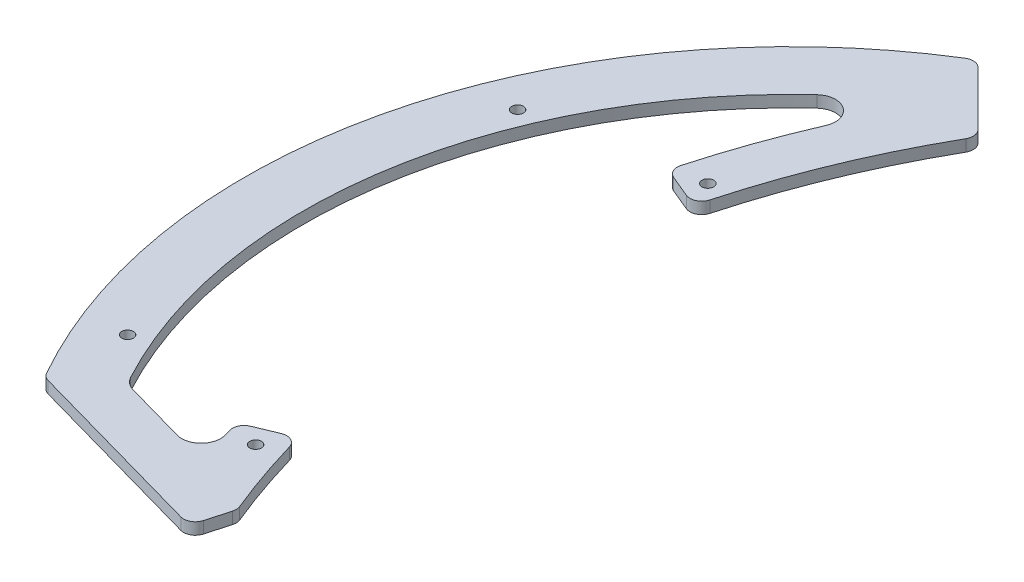
ISO-10303-21;
HEADER;
FILE_DESCRIPTION(('STEP AP214'),'2;1');
FILE_NAME('part.step','',(''),(''),'','','');
FILE_SCHEMA(('AUTOMOTIVE_DESIGN { 1 0 10303 214 1 1 1 1 }'));
ENDSEC;
DATA;
#1=APPLICATION_CONTEXT('core data for automotive mechanical design processes');
#2=APPLICATION_PROTOCOL_DEFINITION('international standard','automotive_design',2000,#1);
#3=PRODUCT_CONTEXT('',#1,'mechanical');
#4=PRODUCT('Part','Part','',(#3));
#5=PRODUCT_RELATED_PRODUCT_CATEGORY('part','',(#4));
#6=PRODUCT_DEFINITION_FORMATION('','',#4);
#7=PRODUCT_DEFINITION_CONTEXT('part definition',#1,'design');
#8=PRODUCT_DEFINITION('design','',#6,#7);
#9=PRODUCT_DEFINITION_SHAPE('','',#8);
#10=(LENGTH_UNIT() NAMED_UNIT(*) SI_UNIT(.MILLI.,.METRE.));
#11=(NAMED_UNIT(*) PLANE_ANGLE_UNIT() SI_UNIT($,.RADIAN.));
#12=(NAMED_UNIT(*) SI_UNIT($,.STERADIAN.) SOLID_ANGLE_UNIT());
#13=UNCERTAINTY_MEASURE_WITH_UNIT(LENGTH_MEASURE(1.E-05),#10,'distance_accuracy_value','');
#14=(GEOMETRIC_REPRESENTATION_CONTEXT(3) GLOBAL_UNCERTAINTY_ASSIGNED_CONTEXT((#13)) GLOBAL_UNIT_ASSIGNED_CONTEXT((#10,
#11,#12)) REPRESENTATION_CONTEXT('',''));
#15=CARTESIAN_POINT('',(0.,0.,0.));
#16=DIRECTION('',(0.,0.,1.));
#17=DIRECTION('',(1.,0.,0.));
#18=AXIS2_PLACEMENT_3D('',#15,#16,#17);
#19=CARTESIAN_POINT('',(117.63315270432,440.56606049208,-1.90202025355329));
#20=DIRECTION('',(0.,-1.,0.));
#21=DIRECTION('',(0.,0.,-1.));
#22=AXIS2_PLACEMENT_3D('',#19,#20,#21);
#23=CYLINDRICAL_SURFACE('',#22,200.);
#24=CARTESIAN_POINT('',(117.63315270432,3.,-1.90202025355329));
#25=DIRECTION('',(0.,1.,0.));
#26=DIRECTION('',(0.,0.,1.));
#27=AXIS2_PLACEMENT_3D('',#24,#25,#26);
#28=CIRCLE('',#27,200.);
#29=CARTESIAN_POINT('',(-75.2973863266759,3.,-54.6069261846831));
#30=VERTEX_POINT('',#29);
#31=CARTESIAN_POINT('',(-56.0777887900128,3.,-101.020680480336));
#32=VERTEX_POINT('',#31);
#33=EDGE_CURVE('E434',#30,#32,#28,.F.);
#34=ORIENTED_EDGE('',*,*,#33,.F.);
#35=DIRECTION('',(0.,-1.,0.));
#36=VECTOR('',#35,1.);
#37=CARTESIAN_POINT('',(-75.297386326676,440.56606049208,-54.6069261846831));
#38=LINE('',#37,#36);
#39=CARTESIAN_POINT('',(-75.2973863266759,0.,-54.6069261846831));
#40=VERTEX_POINT('',#39);
#41=EDGE_CURVE('E306',#30,#40,#38,.T.);
#42=ORIENTED_EDGE('',*,*,#41,.T.);
#43=CARTESIAN_POINT('',(117.63315270432,0.,-1.90202025355329));
#44=DIRECTION('',(0.,1.,0.));
#45=DIRECTION('',(0.,0.,1.));
#46=AXIS2_PLACEMENT_3D('',#43,#44,#45);
#47=CIRCLE('',#46,200.);
#48=CARTESIAN_POINT('',(-56.0777887900128,0.,-101.020680480336));
#49=VERTEX_POINT('',#48);
#50=EDGE_CURVE('E435',#40,#49,#47,.F.);
#51=ORIENTED_EDGE('',*,*,#50,.T.);
#52=DIRECTION('',(0.,-1.,0.));
#53=VECTOR('',#52,1.);
#54=CARTESIAN_POINT('',(-56.0777887900128,440.56606049208,-101.020680480336));
#55=LINE('',#54,#53);
#56=EDGE_CURVE('E304',#49,#32,#55,.F.);
#57=ORIENTED_EDGE('',*,*,#56,.T.);
#58=EDGE_LOOP('',(#34,#42,#51,#57));
#59=FACE_BOUND('',#58,.T.);
#60=ADVANCED_FACE('F37',(#59),#23,.F.);
#61=CARTESIAN_POINT('',(0.,3.,0.));
#62=DIRECTION('',(0.,1.,0.));
#63=DIRECTION('',(0.,0.,1.));
#64=AXIS2_PLACEMENT_3D('',#61,#62,#63);
#65=PLANE('',#64);
#66=DIRECTION('',(0.923076923076923,0.,-0.384615384615384));
#67=VECTOR('',#66,1.);
#68=CARTESIAN_POINT('',(-86.4256486374716,3.,55.5784598675379));
#69=LINE('',#68,#67);
#70=CARTESIAN_POINT('',(-83.9551064148083,3.,54.5490672747615));
#71=VERTEX_POINT('',#70);
#72=CARTESIAN_POINT('',(-78.3835260871652,3.,52.2275754715769));
#73=VERTEX_POINT('',#72);
#74=EDGE_CURVE('E442',#71,#73,#69,.T.);
#75=ORIENTED_EDGE('',*,*,#74,.F.);
#76=CARTESIAN_POINT('',(-82.8012602609622,3.,57.3182980439923));
#77=DIRECTION('',(0.,1.,0.));
#78=DIRECTION('',(0.,0.,1.));
#79=AXIS2_PLACEMENT_3D('',#76,#77,#78);
#80=CIRCLE('',#79,3.);
#81=CARTESIAN_POINT('',(-85.6783092508945,3.,58.1683504597466));
#82=VERTEX_POINT('',#81);
#83=EDGE_CURVE('E272',#71,#82,#80,.T.);
#84=ORIENTED_EDGE('',*,*,#83,.T.);
#85=CARTESIAN_POINT('',(117.63315270432,3.,-1.90202025355329));
#86=DIRECTION('',(0.,-1.,0.));
#87=DIRECTION('',(0.,0.,-1.));
#88=AXIS2_PLACEMENT_3D('',#85,#86,#87);
#89=CIRCLE('',#88,212.);
#90=CARTESIAN_POINT('',(-85.2325066824361,3.,59.6570915137276));
#91=VERTEX_POINT('',#90);
#92=EDGE_CURVE('E450',#91,#82,#89,.T.);
#93=ORIENTED_EDGE('',*,*,#92,.F.);
#94=CARTESIAN_POINT('',(-90.0170741208029,3.,61.1089573572956));
#95=DIRECTION('',(0.,1.,0.));
#96=DIRECTION('',(0.,0.,1.));
#97=AXIS2_PLACEMENT_3D('',#94,#95,#96);
#98=CIRCLE('',#97,5.);
#99=CARTESIAN_POINT('',(-91.3684693577962,3.,65.9228675053386));
#100=VERTEX_POINT('',#99);
#101=EDGE_CURVE('E221',#91,#100,#98,.F.);
#102=ORIENTED_EDGE('',*,*,#101,.T.);
#103=DIRECTION('',(0.962782029608611,0.,0.270279047398652));
#104=VECTOR('',#103,1.);
#105=CARTESIAN_POINT('',(-109.142815318778,3.,60.9331261654206));
#106=LINE('',#105,#104);
#107=CARTESIAN_POINT('',(-107.117650370331,3.,61.5016449331774));
#108=VERTEX_POINT('',#107);
#109=EDGE_CURVE('E455',#108,#100,#106,.T.);
#110=ORIENTED_EDGE('',*,*,#109,.F.);
#111=CARTESIAN_POINT('',(-105.766255133338,3.,56.6877347851343));
#112=DIRECTION('',(0.,1.,0.));
#113=DIRECTION('',(0.,0.,1.));
#114=AXIS2_PLACEMENT_3D('',#111,#112,#113);
#115=CIRCLE('',#114,5.);
#116=CARTESIAN_POINT('',(-110.17318243056,3.,59.0497237345149));
#117=VERTEX_POINT('',#116);
#118=EDGE_CURVE('E220',#108,#117,#115,.F.);
#119=ORIENTED_EDGE('',*,*,#118,.T.);
#120=CARTESIAN_POINT('',(0.,3.,0.));
#121=DIRECTION('',(0.,1.,0.));
#122=DIRECTION('',(0.,0.,1.));
#123=AXIS2_PLACEMENT_3D('',#120,#121,#122);
#124=CIRCLE('',#123,125.);
#125=CARTESIAN_POINT('',(-84.9336652152009,3.,-91.712989882089));
#126=VERTEX_POINT('',#125);
#127=EDGE_CURVE('E725',#126,#117,#124,.T.);
#128=ORIENTED_EDGE('',*,*,#127,.F.);
#129=CARTESIAN_POINT('',(-81.5363186065929,3.,-88.0444702868055));
#130=DIRECTION('',(0.,1.,0.));
#131=DIRECTION('',(0.,0.,1.));
#132=AXIS2_PLACEMENT_3D('',#129,#130,#131);
#133=CIRCLE('',#132,5.);
#134=CARTESIAN_POINT('',(-76.9471602814566,3.,-86.0596212076983));
#135=VERTEX_POINT('',#134);
#136=EDGE_CURVE('E246',#126,#135,#133,.F.);
#137=ORIENTED_EDGE('',*,*,#136,.T.);
#138=CARTESIAN_POINT('',(117.63315270432,3.,-1.90202025355329));
#139=DIRECTION('',(0.,-1.,0.));
#140=DIRECTION('',(0.,0.,-1.));
#141=AXIS2_PLACEMENT_3D('',#138,#139,#140);
#142=CIRCLE('',#141,212.);
#143=CARTESIAN_POINT('',(-86.665258670334,3.,-58.5249759322579));
#144=VERTEX_POINT('',#143);
#145=EDGE_CURVE('E453',#144,#135,#142,.T.);
#146=ORIENTED_EDGE('',*,*,#145,.F.);
#147=CARTESIAN_POINT('',(-83.7742434150322,3.,-57.7237076915215));
#148=DIRECTION('',(0.,1.,0.));
#149=DIRECTION('',(0.,0.,1.));
#150=AXIS2_PLACEMENT_3D('',#147,#148,#149);
#151=CIRCLE('',#150,3.);
#152=CARTESIAN_POINT('',(-84.9280895688784,3.,-54.9544769222907));
#153=VERTEX_POINT('',#152);
#154=EDGE_CURVE('E268',#144,#153,#151,.T.);
#155=ORIENTED_EDGE('',*,*,#154,.T.);
#156=DIRECTION('',(-0.923076923076923,0.,-0.384615384615384));
#157=VECTOR('',#156,1.);
#158=CARTESIAN_POINT('',(-87.3571468989254,3.,-55.9665841431436));
#159=LINE('',#158,#157);
#160=CARTESIAN_POINT('',(-79.345190565987,3.,-52.6282690044193));
#161=VERTEX_POINT('',#160);
#162=EDGE_CURVE('E449',#161,#153,#159,.T.);
#163=ORIENTED_EDGE('',*,*,#162,.F.);
#164=CARTESIAN_POINT('',(-78.1913444121409,3.,-55.3974997736501));
#165=DIRECTION('',(0.,1.,0.));
#166=DIRECTION('',(0.,0.,1.));
#167=AXIS2_PLACEMENT_3D('',#164,#165,#166);
#168=CIRCLE('',#167,3.);
#169=EDGE_CURVE('E266',#161,#30,#168,.T.);
#170=ORIENTED_EDGE('',*,*,#169,.T.);
#171=ORIENTED_EDGE('',*,*,#33,.T.);
#172=CARTESIAN_POINT('',(-58.6834529124278,3.,-102.507460383738));
#173=DIRECTION('',(0.,1.,0.));
#174=DIRECTION('',(0.,0.,1.));
#175=AXIS2_PLACEMENT_3D('',#172,#173,#174);
#176=CIRCLE('',#175,3.);
#177=CARTESIAN_POINT('',(-56.5621325688682,3.,-104.628780727297));
#178=VERTEX_POINT('',#177);
#179=EDGE_CURVE('E264',#32,#178,#176,.T.);
#180=ORIENTED_EDGE('',*,*,#179,.T.);
#181=DIRECTION('',(0.707106781186548,0.,0.707106781186547));
#182=VECTOR('',#181,1.);
#183=CARTESIAN_POINT('',(-72.,3.,-120.066648158429));
#184=LINE('',#183,#182);
#185=CARTESIAN_POINT('',(-70.3296140495267,3.,-118.396262207956));
#186=VERTEX_POINT('',#185);
#187=EDGE_CURVE('E361',#186,#178,#184,.T.);
#188=ORIENTED_EDGE('',*,*,#187,.F.);
#189=CARTESIAN_POINT('',(-72.4509343930863,3.,-116.274941864396));
#190=DIRECTION('',(0.,1.,0.));
#191=DIRECTION('',(0.,0.,1.));
#192=AXIS2_PLACEMENT_3D('',#189,#190,#191);
#193=CIRCLE('',#192,3.);
#194=CARTESIAN_POINT('',(-74.0374512046138,3.,-118.821108474565));
#195=VERTEX_POINT('',#194);
#196=EDGE_CURVE('E262',#186,#195,#193,.T.);
#197=ORIENTED_EDGE('',*,*,#196,.T.);
#198=CARTESIAN_POINT('',(0.,3.,0.));
#199=DIRECTION('',(0.,1.,0.));
#200=DIRECTION('',(0.,0.,1.));
#201=AXIS2_PLACEMENT_3D('',#198,#199,#200);
#202=CIRCLE('',#201,140.);
#203=CARTESIAN_POINT('',(-121.860234865541,3.,68.9208470530875));
#204=VERTEX_POINT('',#203);
#205=EDGE_CURVE('E230',#195,#204,#202,.T.);
#206=ORIENTED_EDGE('',*,*,#205,.T.);
#207=CARTESIAN_POINT('',(-119.248944118423,3.,67.4439717590927));
#208=DIRECTION('',(0.,1.,0.));
#209=DIRECTION('',(0.,0.,1.));
#210=AXIS2_PLACEMENT_3D('',#207,#208,#209);
#211=CIRCLE('',#210,3.);
#212=CARTESIAN_POINT('',(-120.059781260619,3.,70.3323178479186));
#213=VERTEX_POINT('',#212);
#214=EDGE_CURVE('E256',#204,#213,#211,.T.);
#215=ORIENTED_EDGE('',*,*,#214,.T.);
#216=DIRECTION('',(0.962782029608611,0.,0.270279047398653));
#217=VECTOR('',#216,1.);
#218=CARTESIAN_POINT('',(-50.,3.,90.));
#219=LINE('',#218,#217);
#220=CARTESIAN_POINT('',(-72.7272013836812,3.,83.6198577132606));
#221=VERTEX_POINT('',#220);
#222=EDGE_CURVE('E332',#213,#221,#219,.T.);
#223=ORIENTED_EDGE('',*,*,#222,.T.);
#224=CARTESIAN_POINT('',(-71.9163642414853,3.,80.7315116244347));
#225=DIRECTION('',(0.,1.,0.));
#226=DIRECTION('',(0.,0.,1.));
#227=AXIS2_PLACEMENT_3D('',#224,#225,#226);
#228=CIRCLE('',#227,3.);
#229=CARTESIAN_POINT('',(-69.0280181526595,3.,81.5423487666307));
#230=VERTEX_POINT('',#229);
#231=EDGE_CURVE('E258',#221,#230,#228,.T.);
#232=ORIENTED_EDGE('',*,*,#231,.T.);
#233=DIRECTION('',(0.270279047398656,0.,-0.96278202960861));
#234=VECTOR('',#233,1.);
#235=CARTESIAN_POINT('',(-42.7665342383548,3.,-12.0057269236563));
#236=LINE('',#235,#234);
#237=CARTESIAN_POINT('',(-67.3902606781156,3.,75.7083654056405));
#238=VERTEX_POINT('',#237);
#239=EDGE_CURVE('E365',#230,#238,#236,.T.);
#240=ORIENTED_EDGE('',*,*,#239,.T.);
#241=CARTESIAN_POINT('',(-70.2786067669414,3.,74.8975282634445));
#242=DIRECTION('',(0.,1.,0.));
#243=DIRECTION('',(0.,0.,1.));
#244=AXIS2_PLACEMENT_3D('',#241,#242,#243);
#245=CIRCLE('',#244,3.);
#246=CARTESIAN_POINT('',(-67.5015856910114,3.,73.762559566149));
#247=VERTEX_POINT('',#246);
#248=EDGE_CURVE('E260',#238,#247,#245,.T.);
#249=ORIENTED_EDGE('',*,*,#248,.T.);
#250=CARTESIAN_POINT('',(-74.3499336381815,3.,54.1559368837481));
#251=VERTEX_POINT('',#250);
#252=EDGE_CURVE('E443',#247,#251,#28,.F.);
#253=ORIENTED_EDGE('',*,*,#252,.T.);
#254=CARTESIAN_POINT('',(-77.229679933319,3.,54.9968062408076));
#255=DIRECTION('',(0.,1.,0.));
#256=DIRECTION('',(0.,0.,1.));
#257=AXIS2_PLACEMENT_3D('',#254,#255,#256);
#258=CIRCLE('',#257,3.);
#259=EDGE_CURVE('E270',#251,#73,#258,.T.);
#260=ORIENTED_EDGE('',*,*,#259,.T.);
#261=EDGE_LOOP('',(#75,#84,#93,#102,#110,#119,#128,#137,#146,#155,#163,#170,#171,#180,#188,#197,
#206,#215,#223,#232,#240,#249,#253,#260));
#262=FACE_BOUND('',#261,.T.);
#263=CARTESIAN_POINT('',(-120.,3.,50.));
#264=DIRECTION('',(0.,1.,0.));
#265=DIRECTION('',(0.,0.,1.));
#266=AXIS2_PLACEMENT_3D('',#263,#264,#265);
#267=CIRCLE('',#266,1.5);
#268=CARTESIAN_POINT('',(-120.,3.,51.5));
#269=VERTEX_POINT('',#268);
#270=EDGE_CURVE('E364',#269,#269,#267,.T.);
#271=ORIENTED_EDGE('',*,*,#270,.F.);
#272=EDGE_LOOP('',(#271));
#273=FACE_BOUND('',#272,.T.);
#274=CARTESIAN_POINT('',(-120.,3.,-50.));
#275=DIRECTION('',(0.,1.,0.));
#276=DIRECTION('',(0.,0.,1.));
#277=AXIS2_PLACEMENT_3D('',#274,#275,#276);
#278=CIRCLE('',#277,1.5);
#279=CARTESIAN_POINT('',(-120.,3.,-48.5));
#280=VERTEX_POINT('',#279);
#281=EDGE_CURVE('E377',#280,#280,#278,.T.);
#282=ORIENTED_EDGE('',*,*,#281,.F.);
#283=EDGE_LOOP('',(#282));
#284=FACE_BOUND('',#283,.T.);
#285=CARTESIAN_POINT('',(-79.1959594928934,3.,-57.9827560572969));
#286=DIRECTION('',(0.,1.,0.));
#287=DIRECTION('',(0.,0.,1.));
#288=AXIS2_PLACEMENT_3D('',#285,#286,#287);
#289=CIRCLE('',#288,1.49999999999998);
#290=CARTESIAN_POINT('',(-79.1959594928934,3.,-56.482756057297));
#291=VERTEX_POINT('',#290);
#292=EDGE_CURVE('E383',#291,#291,#289,.T.);
#293=ORIENTED_EDGE('',*,*,#292,.F.);
#294=EDGE_LOOP('',(#293));
#295=FACE_BOUND('',#294,.T.);
#296=CARTESIAN_POINT('',(-79.1959594928934,3.,57.982756057297));
#297=DIRECTION('',(0.,1.,0.));
#298=DIRECTION('',(0.,0.,1.));
#299=AXIS2_PLACEMENT_3D('',#296,#297,#298);
#300=CIRCLE('',#299,1.50000000000001);
#301=CARTESIAN_POINT('',(-79.1959594928934,3.,59.482756057297));
#302=VERTEX_POINT('',#301);
#303=EDGE_CURVE('E389',#302,#302,#300,.T.);
#304=ORIENTED_EDGE('',*,*,#303,.F.);
#305=EDGE_LOOP('',(#304));
#306=FACE_BOUND('',#305,.T.);
#307=ADVANCED_FACE('F347',(#262,#273,#284,#295,#306),#65,.T.);
#308=CARTESIAN_POINT('',(0.,0.,0.));
#309=DIRECTION('',(0.,1.,0.));
#310=DIRECTION('',(0.,0.,1.));
#311=AXIS2_PLACEMENT_3D('',#308,#309,#310);
#312=PLANE('',#311);
#313=CARTESIAN_POINT('',(117.63315270432,0.,-1.90202025355329));
#314=DIRECTION('',(0.,1.,0.));
#315=DIRECTION('',(0.,0.,1.));
#316=AXIS2_PLACEMENT_3D('',#313,#314,#315);
#317=CIRCLE('',#316,212.);
#318=CARTESIAN_POINT('',(-85.6783092508945,0.,58.1683504597466));
#319=VERTEX_POINT('',#318);
#320=CARTESIAN_POINT('',(-85.2325066824361,0.,59.6570915137276));
#321=VERTEX_POINT('',#320);
#322=EDGE_CURVE('E199',#319,#321,#317,.T.);
#323=ORIENTED_EDGE('',*,*,#322,.F.);
#324=CARTESIAN_POINT('',(-82.8012602609622,0.,57.3182980439923));
#325=DIRECTION('',(0.,1.,0.));
#326=DIRECTION('',(0.,0.,1.));
#327=AXIS2_PLACEMENT_3D('',#324,#325,#326);
#328=CIRCLE('',#327,3.);
#329=CARTESIAN_POINT('',(-83.9551064148083,0.,54.5490672747615));
#330=VERTEX_POINT('',#329);
#331=EDGE_CURVE('E289',#319,#330,#328,.F.);
#332=ORIENTED_EDGE('',*,*,#331,.T.);
#333=DIRECTION('',(-0.923076923076923,0.,0.384615384615384));
#334=VECTOR('',#333,1.);
#335=CARTESIAN_POINT('',(-86.4256486374716,0.,55.5784598675379));
#336=LINE('',#335,#334);
#337=CARTESIAN_POINT('',(-78.3835260871652,0.,52.2275754715769));
#338=VERTEX_POINT('',#337);
#339=EDGE_CURVE('E209',#338,#330,#336,.T.);
#340=ORIENTED_EDGE('',*,*,#339,.F.);
#341=CARTESIAN_POINT('',(-77.229679933319,0.,54.9968062408076));
#342=DIRECTION('',(0.,1.,0.));
#343=DIRECTION('',(0.,0.,1.));
#344=AXIS2_PLACEMENT_3D('',#341,#342,#343);
#345=CIRCLE('',#344,3.);
#346=CARTESIAN_POINT('',(-74.3499336381815,0.,54.1559368837481));
#347=VERTEX_POINT('',#346);
#348=EDGE_CURVE('E287',#338,#347,#345,.F.);
#349=ORIENTED_EDGE('',*,*,#348,.T.);
#350=CARTESIAN_POINT('',(-67.5015856910114,0.,73.762559566149));
#351=VERTEX_POINT('',#350);
#352=EDGE_CURVE('E429',#351,#347,#47,.F.);
#353=ORIENTED_EDGE('',*,*,#352,.F.);
#354=CARTESIAN_POINT('',(-70.2786067669414,0.,74.8975282634445));
#355=DIRECTION('',(0.,1.,0.));
#356=DIRECTION('',(0.,0.,1.));
#357=AXIS2_PLACEMENT_3D('',#354,#355,#356);
#358=CIRCLE('',#357,3.);
#359=CARTESIAN_POINT('',(-67.3902606781156,0.,75.7083654056405));
#360=VERTEX_POINT('',#359);
#361=EDGE_CURVE('E279',#351,#360,#358,.F.);
#362=ORIENTED_EDGE('',*,*,#361,.T.);
#363=DIRECTION('',(0.270279047398656,0.,-0.96278202960861));
#364=VECTOR('',#363,1.);
#365=CARTESIAN_POINT('',(-42.7665342383548,0.,-12.0057269236563));
#366=LINE('',#365,#364);
#367=CARTESIAN_POINT('',(-69.0280181526595,0.,81.5423487666307));
#368=VERTEX_POINT('',#367);
#369=EDGE_CURVE('E371',#368,#360,#366,.T.);
#370=ORIENTED_EDGE('',*,*,#369,.F.);
#371=CARTESIAN_POINT('',(-71.9163642414853,0.,80.7315116244347));
#372=DIRECTION('',(0.,1.,0.));
#373=DIRECTION('',(0.,0.,1.));
#374=AXIS2_PLACEMENT_3D('',#371,#372,#373);
#375=CIRCLE('',#374,3.);
#376=CARTESIAN_POINT('',(-72.7272013836812,0.,83.6198577132606));
#377=VERTEX_POINT('',#376);
#378=EDGE_CURVE('E277',#368,#377,#375,.F.);
#379=ORIENTED_EDGE('',*,*,#378,.T.);
#380=DIRECTION('',(0.962782029608611,0.,0.270279047398653));
#381=VECTOR('',#380,1.);
#382=CARTESIAN_POINT('',(-50.,0.,90.));
#383=LINE('',#382,#381);
#384=CARTESIAN_POINT('',(-120.059781260619,0.,70.3323178479186));
#385=VERTEX_POINT('',#384);
#386=EDGE_CURVE('E329',#385,#377,#383,.T.);
#387=ORIENTED_EDGE('',*,*,#386,.F.);
#388=CARTESIAN_POINT('',(-119.248944118423,0.,67.4439717590927));
#389=DIRECTION('',(0.,1.,0.));
#390=DIRECTION('',(0.,0.,1.));
#391=AXIS2_PLACEMENT_3D('',#388,#389,#390);
#392=CIRCLE('',#391,3.);
#393=CARTESIAN_POINT('',(-121.860234865541,0.,68.9208470530875));
#394=VERTEX_POINT('',#393);
#395=EDGE_CURVE('E275',#385,#394,#392,.F.);
#396=ORIENTED_EDGE('',*,*,#395,.T.);
#397=CARTESIAN_POINT('',(0.,0.,0.));
#398=DIRECTION('',(0.,1.,0.));
#399=DIRECTION('',(0.,0.,1.));
#400=AXIS2_PLACEMENT_3D('',#397,#398,#399);
#401=CIRCLE('',#400,140.);
#402=CARTESIAN_POINT('',(-74.0374512046138,0.,-118.821108474565));
#403=VERTEX_POINT('',#402);
#404=EDGE_CURVE('E337',#403,#394,#401,.T.);
#405=ORIENTED_EDGE('',*,*,#404,.F.);
#406=CARTESIAN_POINT('',(-72.4509343930863,0.,-116.274941864396));
#407=DIRECTION('',(0.,1.,0.));
#408=DIRECTION('',(0.,0.,1.));
#409=AXIS2_PLACEMENT_3D('',#406,#407,#408);
#410=CIRCLE('',#409,3.);
#411=CARTESIAN_POINT('',(-70.3296140495267,0.,-118.396262207956));
#412=VERTEX_POINT('',#411);
#413=EDGE_CURVE('E52',#403,#412,#410,.F.);
#414=ORIENTED_EDGE('',*,*,#413,.T.);
#415=DIRECTION('',(-0.707106781186548,0.,-0.707106781186547));
#416=VECTOR('',#415,1.);
#417=CARTESIAN_POINT('',(24.0333240792146,0.,-24.0333240792146));
#418=LINE('',#417,#416);
#419=CARTESIAN_POINT('',(-56.5621325688682,0.,-104.628780727297));
#420=VERTEX_POINT('',#419);
#421=EDGE_CURVE('E225',#420,#412,#418,.T.);
#422=ORIENTED_EDGE('',*,*,#421,.F.);
#423=CARTESIAN_POINT('',(-58.6834529124278,0.,-102.507460383738));
#424=DIRECTION('',(0.,1.,0.));
#425=DIRECTION('',(0.,0.,1.));
#426=AXIS2_PLACEMENT_3D('',#423,#424,#425);
#427=CIRCLE('',#426,3.);
#428=EDGE_CURVE('E60',#420,#49,#427,.F.);
#429=ORIENTED_EDGE('',*,*,#428,.T.);
#430=ORIENTED_EDGE('',*,*,#50,.F.);
#431=CARTESIAN_POINT('',(-78.1913444121409,0.,-55.3974997736501));
#432=DIRECTION('',(0.,1.,0.));
#433=DIRECTION('',(0.,0.,1.));
#434=AXIS2_PLACEMENT_3D('',#431,#432,#433);
#435=CIRCLE('',#434,3.);
#436=CARTESIAN_POINT('',(-79.345190565987,0.,-52.6282690044193));
#437=VERTEX_POINT('',#436);
#438=EDGE_CURVE('E283',#40,#437,#435,.F.);
#439=ORIENTED_EDGE('',*,*,#438,.T.);
#440=DIRECTION('',(0.923076923076923,0.,0.384615384615384));
#441=VECTOR('',#440,1.);
#442=CARTESIAN_POINT('',(-87.3571468989254,0.,-55.9665841431436));
#443=LINE('',#442,#441);
#444=CARTESIAN_POINT('',(-84.9280895688784,0.,-54.9544769222907));
#445=VERTEX_POINT('',#444);
#446=EDGE_CURVE('E720',#445,#437,#443,.T.);
#447=ORIENTED_EDGE('',*,*,#446,.F.);
#448=CARTESIAN_POINT('',(-83.7742434150322,0.,-57.7237076915215));
#449=DIRECTION('',(0.,1.,0.));
#450=DIRECTION('',(0.,0.,1.));
#451=AXIS2_PLACEMENT_3D('',#448,#449,#450);
#452=CIRCLE('',#451,3.);
#453=CARTESIAN_POINT('',(-86.665258670334,0.,-58.5249759322579));
#454=VERTEX_POINT('',#453);
#455=EDGE_CURVE('E285',#445,#454,#452,.F.);
#456=ORIENTED_EDGE('',*,*,#455,.T.);
#457=CARTESIAN_POINT('',(117.63315270432,0.,-1.90202025355329));
#458=DIRECTION('',(0.,1.,0.));
#459=DIRECTION('',(0.,0.,1.));
#460=AXIS2_PLACEMENT_3D('',#457,#458,#459);
#461=CIRCLE('',#460,212.);
#462=CARTESIAN_POINT('',(-76.9471602814566,0.,-86.0596212076983));
#463=VERTEX_POINT('',#462);
#464=EDGE_CURVE('E718',#463,#454,#461,.T.);
#465=ORIENTED_EDGE('',*,*,#464,.F.);
#466=CARTESIAN_POINT('',(-81.5363186065929,0.,-88.0444702868055));
#467=DIRECTION('',(0.,1.,0.));
#468=DIRECTION('',(0.,0.,1.));
#469=AXIS2_PLACEMENT_3D('',#466,#467,#468);
#470=CIRCLE('',#469,5.);
#471=CARTESIAN_POINT('',(-84.9336652152009,0.,-91.712989882089));
#472=VERTEX_POINT('',#471);
#473=EDGE_CURVE('E249',#463,#472,#470,.T.);
#474=ORIENTED_EDGE('',*,*,#473,.T.);
#475=CARTESIAN_POINT('',(0.,0.,0.));
#476=DIRECTION('',(0.,1.,0.));
#477=DIRECTION('',(0.,0.,1.));
#478=AXIS2_PLACEMENT_3D('',#475,#476,#477);
#479=CIRCLE('',#478,125.);
#480=CARTESIAN_POINT('',(-110.17318243056,0.,59.0497237345149));
#481=VERTEX_POINT('',#480);
#482=EDGE_CURVE('E723',#481,#472,#479,.F.);
#483=ORIENTED_EDGE('',*,*,#482,.F.);
#484=CARTESIAN_POINT('',(-105.766255133338,0.,56.6877347851343));
#485=DIRECTION('',(0.,1.,0.));
#486=DIRECTION('',(0.,0.,1.));
#487=AXIS2_PLACEMENT_3D('',#484,#485,#486);
#488=CIRCLE('',#487,5.);
#489=CARTESIAN_POINT('',(-107.117650370331,0.,61.5016449331774));
#490=VERTEX_POINT('',#489);
#491=EDGE_CURVE('E244',#481,#490,#488,.T.);
#492=ORIENTED_EDGE('',*,*,#491,.T.);
#493=DIRECTION('',(-0.962782029608612,0.,-0.270279047398652));
#494=VECTOR('',#493,1.);
#495=CARTESIAN_POINT('',(-109.142815318778,0.,60.9331261654206));
#496=LINE('',#495,#494);
#497=CARTESIAN_POINT('',(-91.3684693577962,0.,65.9228675053386));
#498=VERTEX_POINT('',#497);
#499=EDGE_CURVE('E217',#498,#490,#496,.T.);
#500=ORIENTED_EDGE('',*,*,#499,.F.);
#501=CARTESIAN_POINT('',(-90.0170741208029,0.,61.1089573572956));
#502=DIRECTION('',(0.,1.,0.));
#503=DIRECTION('',(0.,0.,1.));
#504=AXIS2_PLACEMENT_3D('',#501,#502,#503);
#505=CIRCLE('',#504,5.);
#506=EDGE_CURVE('E213',#498,#321,#505,.T.);
#507=ORIENTED_EDGE('',*,*,#506,.T.);
#508=EDGE_LOOP('',(#323,#332,#340,#349,#353,#362,#370,#379,#387,#396,#405,#414,#422,#429,#430,
#439,#447,#456,#465,#474,#483,#492,#500,#507));
#509=FACE_BOUND('',#508,.T.);
#510=CARTESIAN_POINT('',(-120.,0.,50.));
#511=DIRECTION('',(0.,1.,0.));
#512=DIRECTION('',(0.,0.,1.));
#513=AXIS2_PLACEMENT_3D('',#510,#511,#512);
#514=CIRCLE('',#513,1.5);
#515=CARTESIAN_POINT('',(-120.,0.,51.5));
#516=VERTEX_POINT('',#515);
#517=EDGE_CURVE('E368',#516,#516,#514,.F.);
#518=ORIENTED_EDGE('',*,*,#517,.F.);
#519=EDGE_LOOP('',(#518));
#520=FACE_BOUND('',#519,.T.);
#521=CARTESIAN_POINT('',(-120.,0.,-50.));
#522=DIRECTION('',(0.,1.,0.));
#523=DIRECTION('',(0.,0.,1.));
#524=AXIS2_PLACEMENT_3D('',#521,#522,#523);
#525=CIRCLE('',#524,1.5);
#526=CARTESIAN_POINT('',(-120.,0.,-48.5));
#527=VERTEX_POINT('',#526);
#528=EDGE_CURVE('E380',#527,#527,#525,.F.);
#529=ORIENTED_EDGE('',*,*,#528,.F.);
#530=EDGE_LOOP('',(#529));
#531=FACE_BOUND('',#530,.T.);
#532=CARTESIAN_POINT('',(-79.1959594928934,0.,-57.9827560572969));
#533=DIRECTION('',(0.,1.,0.));
#534=DIRECTION('',(0.,0.,1.));
#535=AXIS2_PLACEMENT_3D('',#532,#533,#534);
#536=CIRCLE('',#535,1.49999999999998);
#537=CARTESIAN_POINT('',(-79.1959594928934,0.,-56.482756057297));
#538=VERTEX_POINT('',#537);
#539=EDGE_CURVE('E386',#538,#538,#536,.F.);
#540=ORIENTED_EDGE('',*,*,#539,.F.);
#541=EDGE_LOOP('',(#540));
#542=FACE_BOUND('',#541,.T.);
#543=CARTESIAN_POINT('',(-79.1959594928934,0.,57.982756057297));
#544=DIRECTION('',(0.,1.,0.));
#545=DIRECTION('',(0.,0.,1.));
#546=AXIS2_PLACEMENT_3D('',#543,#544,#545);
#547=CIRCLE('',#546,1.50000000000001);
#548=CARTESIAN_POINT('',(-79.1959594928934,0.,59.482756057297));
#549=VERTEX_POINT('',#548);
#550=EDGE_CURVE('E339',#549,#549,#547,.F.);
#551=ORIENTED_EDGE('',*,*,#550,.F.);
#552=EDGE_LOOP('',(#551));
#553=FACE_BOUND('',#552,.T.);
#554=ADVANCED_FACE('F214',(#509,#520,#531,#542,#553),#312,.F.);
#555=CARTESIAN_POINT('',(-50.,3.001,90.));
#556=DIRECTION('',(0.270279047398653,0.,-0.962782029608611));
#557=DIRECTION('',(-0.962782029608611,0.,-0.270279047398653));
#558=AXIS2_PLACEMENT_3D('',#555,#556,#557);
#559=PLANE('',#558);
#560=ORIENTED_EDGE('',*,*,#386,.T.);
#561=DIRECTION('',(0.,-1.,0.));
#562=VECTOR('',#561,1.);
#563=CARTESIAN_POINT('',(-72.7272013836812,3.,83.6198577132606));
#564=LINE('',#563,#562);
#565=EDGE_CURVE('E11',#377,#221,#564,.F.);
#566=ORIENTED_EDGE('',*,*,#565,.T.);
#567=ORIENTED_EDGE('',*,*,#222,.F.);
#568=DIRECTION('',(0.,-1.,0.));
#569=VECTOR('',#568,1.);
#570=CARTESIAN_POINT('',(-120.059781260619,3.001,70.3323178479186));
#571=LINE('',#570,#569);
#572=EDGE_CURVE('E45',#213,#385,#571,.T.);
#573=ORIENTED_EDGE('',*,*,#572,.T.);
#574=EDGE_LOOP('',(#560,#566,#567,#573));
#575=FACE_BOUND('',#574,.T.);
#576=ADVANCED_FACE('F328',(#575),#559,.F.);
#577=CARTESIAN_POINT('',(-72.,3.,-120.066648158429));
#578=DIRECTION('',(0.707106781186547,0.,-0.707106781186548));
#579=DIRECTION('',(-0.707106781186548,0.,-0.707106781186547));
#580=AXIS2_PLACEMENT_3D('',#577,#578,#579);
#581=PLANE('',#580);
#582=ORIENTED_EDGE('',*,*,#187,.T.);
#583=DIRECTION('',(0.,-1.,0.));
#584=VECTOR('',#583,1.);
#585=CARTESIAN_POINT('',(-56.5621325688682,3.,-104.628780727297));
#586=LINE('',#585,#584);
#587=EDGE_CURVE('E311',#178,#420,#586,.T.);
#588=ORIENTED_EDGE('',*,*,#587,.T.);
#589=ORIENTED_EDGE('',*,*,#421,.T.);
#590=DIRECTION('',(0.,1.,0.));
#591=VECTOR('',#590,1.);
#592=CARTESIAN_POINT('',(-70.3296140495267,3.,-118.396262207956));
#593=LINE('',#592,#591);
#594=EDGE_CURVE('E309',#412,#186,#593,.T.);
#595=ORIENTED_EDGE('',*,*,#594,.T.);
#596=EDGE_LOOP('',(#582,#588,#589,#595));
#597=FACE_BOUND('',#596,.T.);
#598=ADVANCED_FACE('F360',(#597),#581,.T.);
#599=CARTESIAN_POINT('',(0.,3.,0.));
#600=DIRECTION('',(0.,-1.,0.));
#601=DIRECTION('',(0.,0.,-1.));
#602=AXIS2_PLACEMENT_3D('',#599,#600,#601);
#603=CYLINDRICAL_SURFACE('',#602,140.);
#604=ORIENTED_EDGE('',*,*,#205,.F.);
#605=DIRECTION('',(0.,-1.,0.));
#606=VECTOR('',#605,1.);
#607=CARTESIAN_POINT('',(-74.0374512046138,3.,-118.821108474565));
#608=LINE('',#607,#606);
#609=EDGE_CURVE('E315',#195,#403,#608,.T.);
#610=ORIENTED_EDGE('',*,*,#609,.T.);
#611=ORIENTED_EDGE('',*,*,#404,.T.);
#612=DIRECTION('',(0.,-1.,0.));
#613=VECTOR('',#612,1.);
#614=CARTESIAN_POINT('',(-121.860234865541,3.,68.9208470530875));
#615=LINE('',#614,#613);
#616=EDGE_CURVE('E313',#394,#204,#615,.F.);
#617=ORIENTED_EDGE('',*,*,#616,.T.);
#618=EDGE_LOOP('',(#604,#610,#611,#617));
#619=FACE_BOUND('',#618,.T.);
#620=ADVANCED_FACE('F354',(#619),#603,.T.);
#621=CARTESIAN_POINT('',(-79.1959594928934,-0.00100000000000013,57.982756057297));
#622=DIRECTION('',(0.,1.,0.));
#623=DIRECTION('',(0.,0.,1.));
#624=AXIS2_PLACEMENT_3D('',#621,#622,#623);
#625=CYLINDRICAL_SURFACE('',#624,1.50000000000001);
#626=ORIENTED_EDGE('',*,*,#303,.T.);
#627=EDGE_LOOP('',(#626));
#628=FACE_BOUND('',#627,.T.);
#629=ORIENTED_EDGE('',*,*,#550,.T.);
#630=EDGE_LOOP('',(#629));
#631=FACE_BOUND('',#630,.T.);
#632=ADVANCED_FACE('F394',(#628,#631),#625,.F.);
#633=CARTESIAN_POINT('',(-79.1959594928934,-0.00100000000000013,-57.9827560572969));
#634=DIRECTION('',(0.,1.,0.));
#635=DIRECTION('',(0.,0.,1.));
#636=AXIS2_PLACEMENT_3D('',#633,#634,#635);
#637=CYLINDRICAL_SURFACE('',#636,1.49999999999998);
#638=ORIENTED_EDGE('',*,*,#292,.T.);
#639=EDGE_LOOP('',(#638));
#640=FACE_BOUND('',#639,.T.);
#641=ORIENTED_EDGE('',*,*,#539,.T.);
#642=EDGE_LOOP('',(#641));
#643=FACE_BOUND('',#642,.T.);
#644=ADVANCED_FACE('F512',(#640,#643),#637,.F.);
#645=CARTESIAN_POINT('',(-120.,-0.00100000000000013,-50.));
#646=DIRECTION('',(0.,1.,0.));
#647=DIRECTION('',(0.,0.,1.));
#648=AXIS2_PLACEMENT_3D('',#645,#646,#647);
#649=CYLINDRICAL_SURFACE('',#648,1.5);
#650=ORIENTED_EDGE('',*,*,#281,.T.);
#651=EDGE_LOOP('',(#650));
#652=FACE_BOUND('',#651,.T.);
#653=ORIENTED_EDGE('',*,*,#528,.T.);
#654=EDGE_LOOP('',(#653));
#655=FACE_BOUND('',#654,.T.);
#656=ADVANCED_FACE('F424',(#652,#655),#649,.F.);
#657=CARTESIAN_POINT('',(-120.,-0.00100000000000013,50.));
#658=DIRECTION('',(0.,1.,0.));
#659=DIRECTION('',(0.,0.,1.));
#660=AXIS2_PLACEMENT_3D('',#657,#658,#659);
#661=CYLINDRICAL_SURFACE('',#660,1.5);
#662=ORIENTED_EDGE('',*,*,#270,.T.);
#663=EDGE_LOOP('',(#662));
#664=FACE_BOUND('',#663,.T.);
#665=ORIENTED_EDGE('',*,*,#517,.T.);
#666=EDGE_LOOP('',(#665));
#667=FACE_BOUND('',#666,.T.);
#668=ADVANCED_FACE('F416',(#664,#667),#661,.F.);
#669=ORIENTED_EDGE('',*,*,#352,.T.);
#670=DIRECTION('',(0.,-1.,0.));
#671=VECTOR('',#670,1.);
#672=CARTESIAN_POINT('',(-74.3499336381815,440.56606049208,54.1559368837481));
#673=LINE('',#672,#671);
#674=EDGE_CURVE('E294',#347,#251,#673,.F.);
#675=ORIENTED_EDGE('',*,*,#674,.T.);
#676=ORIENTED_EDGE('',*,*,#252,.F.);
#677=DIRECTION('',(0.,-1.,0.));
#678=VECTOR('',#677,1.);
#679=CARTESIAN_POINT('',(-67.5015856910114,440.56606049208,73.762559566149));
#680=LINE('',#679,#678);
#681=EDGE_CURVE('E291',#247,#351,#680,.T.);
#682=ORIENTED_EDGE('',*,*,#681,.T.);
#683=EDGE_LOOP('',(#669,#675,#676,#682));
#684=FACE_BOUND('',#683,.T.);
#685=ADVANCED_FACE('F408',(#684),#23,.F.);
#686=CARTESIAN_POINT('',(-67.1106137176095,440.56606049208,74.7122132036802));
#687=DIRECTION('',(0.96278202960861,0.,0.270279047398656));
#688=DIRECTION('',(0.270279047398656,0.,-0.96278202960861));
#689=AXIS2_PLACEMENT_3D('',#686,#687,#688);
#690=PLANE('',#689);
#691=ORIENTED_EDGE('',*,*,#369,.T.);
#692=DIRECTION('',(0.,-1.,0.));
#693=VECTOR('',#692,1.);
#694=CARTESIAN_POINT('',(-67.3902606781156,440.56606049208,75.7083654056405));
#695=LINE('',#694,#693);
#696=EDGE_CURVE('E321',#360,#238,#695,.F.);
#697=ORIENTED_EDGE('',*,*,#696,.T.);
#698=ORIENTED_EDGE('',*,*,#239,.F.);
#699=DIRECTION('',(0.,-1.,0.));
#700=VECTOR('',#699,1.);
#701=CARTESIAN_POINT('',(-69.0280181526595,0.,81.5423487666307));
#702=LINE('',#701,#700);
#703=EDGE_CURVE('E318',#230,#368,#702,.T.);
#704=ORIENTED_EDGE('',*,*,#703,.T.);
#705=EDGE_LOOP('',(#691,#697,#698,#704));
#706=FACE_BOUND('',#705,.T.);
#707=ADVANCED_FACE('F415',(#706),#690,.T.);
#708=CARTESIAN_POINT('',(0.,-0.00100000000000013,0.));
#709=DIRECTION('',(0.,1.,0.));
#710=DIRECTION('',(0.,0.,1.));
#711=AXIS2_PLACEMENT_3D('',#708,#709,#710);
#712=CYLINDRICAL_SURFACE('',#711,125.);
#713=ORIENTED_EDGE('',*,*,#127,.T.);
#714=DIRECTION('',(0.,1.,0.));
#715=VECTOR('',#714,1.);
#716=CARTESIAN_POINT('',(-110.17318243056,-0.00100000000000013,59.0497237345149));
#717=LINE('',#716,#715);
#718=EDGE_CURVE('E238',#117,#481,#717,.F.);
#719=ORIENTED_EDGE('',*,*,#718,.T.);
#720=ORIENTED_EDGE('',*,*,#482,.T.);
#721=DIRECTION('',(0.,1.,0.));
#722=VECTOR('',#721,1.);
#723=CARTESIAN_POINT('',(-84.9336652152009,-0.00100000000000013,-91.712989882089));
#724=LINE('',#723,#722);
#725=EDGE_CURVE('E235',#472,#126,#724,.T.);
#726=ORIENTED_EDGE('',*,*,#725,.T.);
#727=EDGE_LOOP('',(#713,#719,#720,#726));
#728=FACE_BOUND('',#727,.T.);
#729=ADVANCED_FACE('F422',(#728),#712,.F.);
#730=CARTESIAN_POINT('',(117.63315270432,-0.00100000000000013,-1.90202025355329));
#731=DIRECTION('',(0.,1.,0.));
#732=DIRECTION('',(0.,0.,1.));
#733=AXIS2_PLACEMENT_3D('',#730,#731,#732);
#734=CYLINDRICAL_SURFACE('',#733,212.);
#735=ORIENTED_EDGE('',*,*,#464,.T.);
#736=DIRECTION('',(0.,1.,0.));
#737=VECTOR('',#736,1.);
#738=CARTESIAN_POINT('',(-86.665258670334,-0.00100000000000013,-58.5249759322579));
#739=LINE('',#738,#737);
#740=EDGE_CURVE('E297',#454,#144,#739,.T.);
#741=ORIENTED_EDGE('',*,*,#740,.T.);
#742=ORIENTED_EDGE('',*,*,#145,.T.);
#743=DIRECTION('',(0.,1.,0.));
#744=VECTOR('',#743,1.);
#745=CARTESIAN_POINT('',(-76.9471602814566,-0.00100000000000013,-86.0596212076983));
#746=LINE('',#745,#744);
#747=EDGE_CURVE('E240',#135,#463,#746,.F.);
#748=ORIENTED_EDGE('',*,*,#747,.T.);
#749=EDGE_LOOP('',(#735,#741,#742,#748));
#750=FACE_BOUND('',#749,.T.);
#751=ADVANCED_FACE('F553',(#750),#734,.T.);
#752=CARTESIAN_POINT('',(-87.3571468989254,-0.00100000000000013,-55.9665841431436));
#753=DIRECTION('',(0.384615384615384,0.,-0.923076923076923));
#754=DIRECTION('',(-0.923076923076923,0.,-0.384615384615384));
#755=AXIS2_PLACEMENT_3D('',#752,#753,#754);
#756=PLANE('',#755);
#757=ORIENTED_EDGE('',*,*,#162,.T.);
#758=DIRECTION('',(0.,1.,0.));
#759=VECTOR('',#758,1.);
#760=CARTESIAN_POINT('',(-84.9280895688784,-0.00100000000000013,-54.9544769222907));
#761=LINE('',#760,#759);
#762=EDGE_CURVE('E302',#153,#445,#761,.F.);
#763=ORIENTED_EDGE('',*,*,#762,.T.);
#764=ORIENTED_EDGE('',*,*,#446,.T.);
#765=DIRECTION('',(0.,1.,0.));
#766=VECTOR('',#765,1.);
#767=CARTESIAN_POINT('',(-79.345190565987,3.,-52.6282690044193));
#768=LINE('',#767,#766);
#769=EDGE_CURVE('E300',#437,#161,#768,.T.);
#770=ORIENTED_EDGE('',*,*,#769,.T.);
#771=EDGE_LOOP('',(#757,#763,#764,#770));
#772=FACE_BOUND('',#771,.T.);
#773=ADVANCED_FACE('F629',(#772),#756,.F.);
#774=CARTESIAN_POINT('',(-86.4256486374716,-0.00100000000000013,55.5784598675379));
#775=DIRECTION('',(0.384615384615384,0.,0.923076923076923));
#776=DIRECTION('',(0.923076923076923,0.,-0.384615384615384));
#777=AXIS2_PLACEMENT_3D('',#774,#775,#776);
#778=PLANE('',#777);
#779=ORIENTED_EDGE('',*,*,#339,.T.);
#780=DIRECTION('',(0.,1.,0.));
#781=VECTOR('',#780,1.);
#782=CARTESIAN_POINT('',(-83.9551064148083,-0.00100000000000013,54.5490672747615));
#783=LINE('',#782,#781);
#784=EDGE_CURVE('E253',#330,#71,#783,.T.);
#785=ORIENTED_EDGE('',*,*,#784,.T.);
#786=ORIENTED_EDGE('',*,*,#74,.T.);
#787=DIRECTION('',(0.,1.,0.));
#788=VECTOR('',#787,1.);
#789=CARTESIAN_POINT('',(-78.3835260871652,0.,52.2275754715769));
#790=LINE('',#789,#788);
#791=EDGE_CURVE('E251',#73,#338,#790,.F.);
#792=ORIENTED_EDGE('',*,*,#791,.T.);
#793=EDGE_LOOP('',(#779,#785,#786,#792));
#794=FACE_BOUND('',#793,.T.);
#795=ADVANCED_FACE('F446',(#794),#778,.F.);
#796=CARTESIAN_POINT('',(117.63315270432,-0.00100000000000013,-1.90202025355329));
#797=DIRECTION('',(0.,1.,0.));
#798=DIRECTION('',(0.,0.,1.));
#799=AXIS2_PLACEMENT_3D('',#796,#797,#798);
#800=CYLINDRICAL_SURFACE('',#799,212.);
#801=ORIENTED_EDGE('',*,*,#92,.T.);
#802=DIRECTION('',(0.,1.,0.));
#803=VECTOR('',#802,1.);
#804=CARTESIAN_POINT('',(-85.6783092508945,-0.00100000000000013,58.1683504597465));
#805=LINE('',#804,#803);
#806=EDGE_CURVE('E207',#82,#319,#805,.F.);
#807=ORIENTED_EDGE('',*,*,#806,.T.);
#808=ORIENTED_EDGE('',*,*,#322,.T.);
#809=DIRECTION('',(0.,1.,0.));
#810=VECTOR('',#809,1.);
#811=CARTESIAN_POINT('',(-85.232506682436,-0.00100000000000013,59.6570915137276));
#812=LINE('',#811,#810);
#813=EDGE_CURVE('E204',#321,#91,#812,.T.);
#814=ORIENTED_EDGE('',*,*,#813,.T.);
#815=EDGE_LOOP('',(#801,#807,#808,#814));
#816=FACE_BOUND('',#815,.T.);
#817=ADVANCED_FACE('F202',(#816),#800,.T.);
#818=CARTESIAN_POINT('',(-109.142815318778,-0.00100000000000013,60.9331261654206));
#819=DIRECTION('',(-0.270279047398652,0.,0.962782029608611));
#820=DIRECTION('',(0.962782029608612,0.,0.270279047398652));
#821=AXIS2_PLACEMENT_3D('',#818,#819,#820);
#822=PLANE('',#821);
#823=ORIENTED_EDGE('',*,*,#109,.T.);
#824=DIRECTION('',(0.,-1.,0.));
#825=VECTOR('',#824,1.);
#826=CARTESIAN_POINT('',(-91.3684693577962,0.,65.9228675053386));
#827=LINE('',#826,#825);
#828=EDGE_CURVE('E228',#100,#498,#827,.T.);
#829=ORIENTED_EDGE('',*,*,#828,.T.);
#830=ORIENTED_EDGE('',*,*,#499,.T.);
#831=DIRECTION('',(0.,-1.,0.));
#832=VECTOR('',#831,1.);
#833=CARTESIAN_POINT('',(-107.117650370331,3.,61.5016449331774));
#834=LINE('',#833,#832);
#835=EDGE_CURVE('E224',#490,#108,#834,.F.);
#836=ORIENTED_EDGE('',*,*,#835,.T.);
#837=EDGE_LOOP('',(#823,#829,#830,#836));
#838=FACE_BOUND('',#837,.T.);
#839=ADVANCED_FACE('F506',(#838),#822,.F.);
#840=CARTESIAN_POINT('',(-90.0170741208029,-0.00100000000000013,61.1089573572956));
#841=DIRECTION('',(0.,1.,0.));
#842=DIRECTION('',(0.,0.,1.));
#843=AXIS2_PLACEMENT_3D('',#840,#841,#842);
#844=CYLINDRICAL_SURFACE('',#843,5.);
#845=ORIENTED_EDGE('',*,*,#506,.F.);
#846=ORIENTED_EDGE('',*,*,#828,.F.);
#847=ORIENTED_EDGE('',*,*,#101,.F.);
#848=ORIENTED_EDGE('',*,*,#813,.F.);
#849=EDGE_LOOP('',(#845,#846,#847,#848));
#850=FACE_BOUND('',#849,.T.);
#851=ADVANCED_FACE('F223',(#850),#844,.F.);
#852=CARTESIAN_POINT('',(-105.766255133338,-0.00100000000000013,56.6877347851343));
#853=DIRECTION('',(0.,1.,0.));
#854=DIRECTION('',(0.,0.,1.));
#855=AXIS2_PLACEMENT_3D('',#852,#853,#854);
#856=CYLINDRICAL_SURFACE('',#855,5.);
#857=ORIENTED_EDGE('',*,*,#491,.F.);
#858=ORIENTED_EDGE('',*,*,#718,.F.);
#859=ORIENTED_EDGE('',*,*,#118,.F.);
#860=ORIENTED_EDGE('',*,*,#835,.F.);
#861=EDGE_LOOP('',(#857,#858,#859,#860));
#862=FACE_BOUND('',#861,.T.);
#863=ADVANCED_FACE('F500',(#862),#856,.F.);
#864=CARTESIAN_POINT('',(-81.5363186065929,-0.00100000000000013,-88.0444702868055));
#865=DIRECTION('',(0.,1.,0.));
#866=DIRECTION('',(0.,0.,1.));
#867=AXIS2_PLACEMENT_3D('',#864,#865,#866);
#868=CYLINDRICAL_SURFACE('',#867,5.);
#869=ORIENTED_EDGE('',*,*,#473,.F.);
#870=ORIENTED_EDGE('',*,*,#747,.F.);
#871=ORIENTED_EDGE('',*,*,#136,.F.);
#872=ORIENTED_EDGE('',*,*,#725,.F.);
#873=EDGE_LOOP('',(#869,#870,#871,#872));
#874=FACE_BOUND('',#873,.T.);
#875=ADVANCED_FACE('F496',(#874),#868,.F.);
#876=CARTESIAN_POINT('',(-82.8012602609622,-0.00100000000000013,57.3182980439923));
#877=DIRECTION('',(0.,1.,0.));
#878=DIRECTION('',(0.,0.,1.));
#879=AXIS2_PLACEMENT_3D('',#876,#877,#878);
#880=CYLINDRICAL_SURFACE('',#879,3.);
#881=ORIENTED_EDGE('',*,*,#331,.F.);
#882=ORIENTED_EDGE('',*,*,#806,.F.);
#883=ORIENTED_EDGE('',*,*,#83,.F.);
#884=ORIENTED_EDGE('',*,*,#784,.F.);
#885=EDGE_LOOP('',(#881,#882,#883,#884));
#886=FACE_BOUND('',#885,.T.);
#887=ADVANCED_FACE('F493',(#886),#880,.T.);
#888=CARTESIAN_POINT('',(-77.229679933319,440.56606049208,54.9968062408076));
#889=DIRECTION('',(0.,-1.,0.));
#890=DIRECTION('',(0.,0.,-1.));
#891=AXIS2_PLACEMENT_3D('',#888,#889,#890);
#892=CYLINDRICAL_SURFACE('',#891,3.);
#893=ORIENTED_EDGE('',*,*,#348,.F.);
#894=ORIENTED_EDGE('',*,*,#791,.F.);
#895=ORIENTED_EDGE('',*,*,#259,.F.);
#896=ORIENTED_EDGE('',*,*,#674,.F.);
#897=EDGE_LOOP('',(#893,#894,#895,#896));
#898=FACE_BOUND('',#897,.T.);
#899=ADVANCED_FACE('F439',(#898),#892,.T.);
#900=CARTESIAN_POINT('',(-83.7742434150322,-0.00100000000000013,-57.7237076915215));
#901=DIRECTION('',(0.,1.,0.));
#902=DIRECTION('',(0.,0.,1.));
#903=AXIS2_PLACEMENT_3D('',#900,#901,#902);
#904=CYLINDRICAL_SURFACE('',#903,3.);
#905=ORIENTED_EDGE('',*,*,#455,.F.);
#906=ORIENTED_EDGE('',*,*,#762,.F.);
#907=ORIENTED_EDGE('',*,*,#154,.F.);
#908=ORIENTED_EDGE('',*,*,#740,.F.);
#909=EDGE_LOOP('',(#905,#906,#907,#908));
#910=FACE_BOUND('',#909,.T.);
#911=ADVANCED_FACE('F486',(#910),#904,.T.);
#912=CARTESIAN_POINT('',(-78.1913444121409,440.56606049208,-55.3974997736501));
#913=DIRECTION('',(0.,-1.,0.));
#914=DIRECTION('',(0.,0.,-1.));
#915=AXIS2_PLACEMENT_3D('',#912,#913,#914);
#916=CYLINDRICAL_SURFACE('',#915,3.);
#917=ORIENTED_EDGE('',*,*,#169,.F.);
#918=ORIENTED_EDGE('',*,*,#769,.F.);
#919=ORIENTED_EDGE('',*,*,#438,.F.);
#920=ORIENTED_EDGE('',*,*,#41,.F.);
#921=EDGE_LOOP('',(#917,#918,#919,#920));
#922=FACE_BOUND('',#921,.T.);
#923=ADVANCED_FACE('F483',(#922),#916,.T.);
#924=CARTESIAN_POINT('',(-58.6834529124278,440.56606049208,-102.507460383738));
#925=DIRECTION('',(0.,-1.,0.));
#926=DIRECTION('',(0.,0.,-1.));
#927=AXIS2_PLACEMENT_3D('',#924,#925,#926);
#928=CYLINDRICAL_SURFACE('',#927,3.);
#929=ORIENTED_EDGE('',*,*,#179,.F.);
#930=ORIENTED_EDGE('',*,*,#56,.F.);
#931=ORIENTED_EDGE('',*,*,#428,.F.);
#932=ORIENTED_EDGE('',*,*,#587,.F.);
#933=EDGE_LOOP('',(#929,#930,#931,#932));
#934=FACE_BOUND('',#933,.T.);
#935=ADVANCED_FACE('F480',(#934),#928,.T.);
#936=CARTESIAN_POINT('',(-72.4509343930863,3.,-116.274941864396));
#937=DIRECTION('',(0.,-1.,0.));
#938=DIRECTION('',(0.,0.,-1.));
#939=AXIS2_PLACEMENT_3D('',#936,#937,#938);
#940=CYLINDRICAL_SURFACE('',#939,3.);
#941=ORIENTED_EDGE('',*,*,#196,.F.);
#942=ORIENTED_EDGE('',*,*,#594,.F.);
#943=ORIENTED_EDGE('',*,*,#413,.F.);
#944=ORIENTED_EDGE('',*,*,#609,.F.);
#945=EDGE_LOOP('',(#941,#942,#943,#944));
#946=FACE_BOUND('',#945,.T.);
#947=ADVANCED_FACE('F356',(#946),#940,.T.);
#948=CARTESIAN_POINT('',(-70.2786067669414,440.56606049208,74.8975282634445));
#949=DIRECTION('',(0.,-1.,0.));
#950=DIRECTION('',(0.,0.,-1.));
#951=AXIS2_PLACEMENT_3D('',#948,#949,#950);
#952=CYLINDRICAL_SURFACE('',#951,3.);
#953=ORIENTED_EDGE('',*,*,#248,.F.);
#954=ORIENTED_EDGE('',*,*,#696,.F.);
#955=ORIENTED_EDGE('',*,*,#361,.F.);
#956=ORIENTED_EDGE('',*,*,#681,.F.);
#957=EDGE_LOOP('',(#953,#954,#955,#956));
#958=FACE_BOUND('',#957,.T.);
#959=ADVANCED_FACE('F467',(#958),#952,.T.);
#960=CARTESIAN_POINT('',(-71.9163642414853,440.56606049208,80.7315116244347));
#961=DIRECTION('',(0.,1.,0.));
#962=DIRECTION('',(0.,0.,1.));
#963=AXIS2_PLACEMENT_3D('',#960,#961,#962);
#964=CYLINDRICAL_SURFACE('',#963,3.);
#965=ORIENTED_EDGE('',*,*,#231,.F.);
#966=ORIENTED_EDGE('',*,*,#565,.F.);
#967=ORIENTED_EDGE('',*,*,#378,.F.);
#968=ORIENTED_EDGE('',*,*,#703,.F.);
#969=EDGE_LOOP('',(#965,#966,#967,#968));
#970=FACE_BOUND('',#969,.T.);
#971=ADVANCED_FACE('F470',(#970),#964,.T.);
#972=CARTESIAN_POINT('',(-119.248944118423,3.,67.4439717590927));
#973=DIRECTION('',(0.,-1.,0.));
#974=DIRECTION('',(0.,0.,-1.));
#975=AXIS2_PLACEMENT_3D('',#972,#973,#974);
#976=CYLINDRICAL_SURFACE('',#975,3.);
#977=ORIENTED_EDGE('',*,*,#214,.F.);
#978=ORIENTED_EDGE('',*,*,#616,.F.);
#979=ORIENTED_EDGE('',*,*,#395,.F.);
#980=ORIENTED_EDGE('',*,*,#572,.F.);
#981=EDGE_LOOP('',(#977,#978,#979,#980));
#982=FACE_BOUND('',#981,.T.);
#983=ADVANCED_FACE('F39',(#982),#976,.T.);
#984=CLOSED_SHELL('',(#60,#307,#554,#576,#598,#620,#632,#644,#656,#668,#685,#707,#729,#751,#773,
#795,#817,#839,#851,#863,#875,#887,#899,#911,#923,#935,#947,#959,#971,#983));
#985=MANIFOLD_SOLID_BREP('B2',#984);
#986=ADVANCED_BREP_SHAPE_REPRESENTATION('',(#18,#985),#14);
#987=SHAPE_DEFINITION_REPRESENTATION(#9,#986);
ENDSEC;
END-ISO-10303-21;
